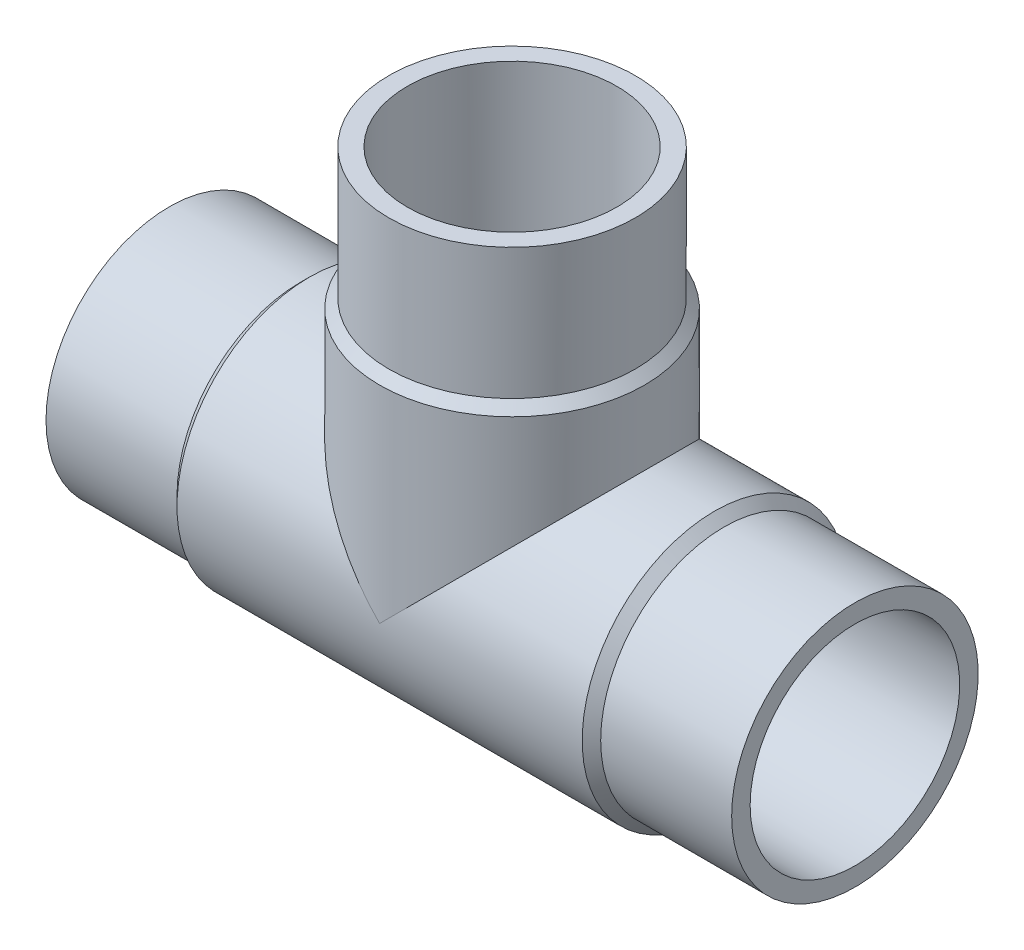
ISO-10303-21;
HEADER;
FILE_DESCRIPTION(('STEP AP214'),'2;1');
FILE_NAME('part.step','',(''),(''),'','','');
FILE_SCHEMA(('AUTOMOTIVE_DESIGN { 1 0 10303 214 1 1 1 1 }'));
ENDSEC;
DATA;
#1=APPLICATION_CONTEXT('core data for automotive mechanical design processes');
#2=APPLICATION_PROTOCOL_DEFINITION('international standard','automotive_design',2000,#1);
#3=PRODUCT_CONTEXT('',#1,'mechanical');
#4=PRODUCT('Part','Part','',(#3));
#5=PRODUCT_RELATED_PRODUCT_CATEGORY('part','',(#4));
#6=PRODUCT_DEFINITION_FORMATION('','',#4);
#7=PRODUCT_DEFINITION_CONTEXT('part definition',#1,'design');
#8=PRODUCT_DEFINITION('design','',#6,#7);
#9=PRODUCT_DEFINITION_SHAPE('','',#8);
#10=(LENGTH_UNIT() NAMED_UNIT(*) SI_UNIT(.MILLI.,.METRE.));
#11=(NAMED_UNIT(*) PLANE_ANGLE_UNIT() SI_UNIT($,.RADIAN.));
#12=(NAMED_UNIT(*) SI_UNIT($,.STERADIAN.) SOLID_ANGLE_UNIT());
#13=UNCERTAINTY_MEASURE_WITH_UNIT(LENGTH_MEASURE(1.E-05),#10,'distance_accuracy_value','');
#14=(GEOMETRIC_REPRESENTATION_CONTEXT(3) GLOBAL_UNCERTAINTY_ASSIGNED_CONTEXT((#13)) GLOBAL_UNIT_ASSIGNED_CONTEXT((#10,
#11,#12)) REPRESENTATION_CONTEXT('',''));
#15=CARTESIAN_POINT('',(0.,0.,0.));
#16=DIRECTION('',(0.,0.,1.));
#17=DIRECTION('',(1.,0.,0.));
#18=AXIS2_PLACEMENT_3D('',#15,#16,#17);
#19=CARTESIAN_POINT('',(-44.5,45.,0.));
#20=DIRECTION('',(0.,1.,0.));
#21=DIRECTION('',(0.,0.,1.));
#22=AXIS2_PLACEMENT_3D('',#19,#20,#21);
#23=CYLINDRICAL_SURFACE('',#22,16.);
#24=CARTESIAN_POINT('',(-44.5,45.,0.));
#25=DIRECTION('',(0.,1.,0.));
#26=DIRECTION('',(0.,0.,1.));
#27=AXIS2_PLACEMENT_3D('',#24,#25,#26);
#28=CIRCLE('',#27,16.);
#29=CARTESIAN_POINT('',(-44.5,45.,16.));
#30=VERTEX_POINT('',#29);
#31=EDGE_CURVE('E18',#30,#30,#28,.T.);
#32=ORIENTED_EDGE('',*,*,#31,.F.);
#33=EDGE_LOOP('',(#32));
#34=FACE_BOUND('',#33,.T.);
#35=CARTESIAN_POINT('',(-44.5,28.,0.));
#36=DIRECTION('',(0.,1.,0.));
#37=DIRECTION('',(1.,0.,0.));
#38=AXIS2_PLACEMENT_3D('',#35,#36,#37);
#39=CIRCLE('',#38,16.);
#40=CARTESIAN_POINT('',(-28.5,28.,0.));
#41=VERTEX_POINT('',#40);
#42=EDGE_CURVE('E71',#41,#41,#39,.F.);
#43=ORIENTED_EDGE('',*,*,#42,.F.);
#44=EDGE_LOOP('',(#43));
#45=FACE_BOUND('',#44,.T.);
#46=ADVANCED_FACE('F15',(#34,#45),#23,.T.);
#47=CARTESIAN_POINT('',(-44.5,28.,0.));
#48=DIRECTION('',(0.,-1.,0.));
#49=DIRECTION('',(0.,0.,-1.));
#50=AXIS2_PLACEMENT_3D('',#47,#48,#49);
#51=CONICAL_SURFACE('',#50,16.,0.785398163397469);
#52=CARTESIAN_POINT('',(-44.5,26.8,0.));
#53=DIRECTION('',(0.,1.,0.));
#54=DIRECTION('',(1.,0.,0.));
#55=AXIS2_PLACEMENT_3D('',#52,#53,#54);
#56=CIRCLE('',#55,17.2);
#57=CARTESIAN_POINT('',(-27.3,26.8,0.));
#58=VERTEX_POINT('',#57);
#59=EDGE_CURVE('E60',#58,#58,#56,.F.);
#60=ORIENTED_EDGE('',*,*,#59,.F.);
#61=EDGE_LOOP('',(#60));
#62=FACE_BOUND('',#61,.T.);
#63=ORIENTED_EDGE('',*,*,#42,.T.);
#64=EDGE_LOOP('',(#63));
#65=FACE_BOUND('',#64,.T.);
#66=ADVANCED_FACE('F141',(#62,#65),#51,.T.);
#67=CARTESIAN_POINT('',(-17.,0.,0.));
#68=DIRECTION('',(-1.,0.,0.));
#69=DIRECTION('',(0.,0.,1.));
#70=AXIS2_PLACEMENT_3D('',#67,#68,#69);
#71=CYLINDRICAL_SURFACE('',#70,16.);
#72=CARTESIAN_POINT('',(-17.,0.,0.));
#73=DIRECTION('',(1.,0.,0.));
#74=DIRECTION('',(0.,1.,0.));
#75=AXIS2_PLACEMENT_3D('',#72,#73,#74);
#76=CIRCLE('',#75,16.);
#77=CARTESIAN_POINT('',(-17.,16.,0.));
#78=VERTEX_POINT('',#77);
#79=EDGE_CURVE('E64',#78,#78,#76,.F.);
#80=ORIENTED_EDGE('',*,*,#79,.F.);
#81=EDGE_LOOP('',(#80));
#82=FACE_BOUND('',#81,.T.);
#83=CARTESIAN_POINT('',(0.,0.,0.));
#84=DIRECTION('',(-1.,0.,0.));
#85=DIRECTION('',(0.,0.,1.));
#86=AXIS2_PLACEMENT_3D('',#83,#84,#85);
#87=CIRCLE('',#86,16.);
#88=CARTESIAN_POINT('',(0.,0.,16.));
#89=VERTEX_POINT('',#88);
#90=EDGE_CURVE('E58',#89,#89,#87,.F.);
#91=ORIENTED_EDGE('',*,*,#90,.F.);
#92=EDGE_LOOP('',(#91));
#93=FACE_BOUND('',#92,.T.);
#94=ADVANCED_FACE('F136',(#82,#93),#71,.T.);
#95=CARTESIAN_POINT('',(-60.5,45.,16.1920021083504));
#96=DIRECTION('',(0.,1.,0.));
#97=DIRECTION('',(1.,0.,0.));
#98=AXIS2_PLACEMENT_3D('',#95,#96,#97);
#99=PLANE('',#98);
#100=CARTESIAN_POINT('',(-44.5,45.,0.));
#101=DIRECTION('',(0.,1.,0.));
#102=DIRECTION('',(0.,0.,1.));
#103=AXIS2_PLACEMENT_3D('',#100,#101,#102);
#104=CIRCLE('',#103,13.6);
#105=CARTESIAN_POINT('',(-44.5,45.,13.6));
#106=VERTEX_POINT('',#105);
#107=EDGE_CURVE('E52',#106,#106,#104,.T.);
#108=ORIENTED_EDGE('',*,*,#107,.F.);
#109=EDGE_LOOP('',(#108));
#110=FACE_BOUND('',#109,.T.);
#111=ORIENTED_EDGE('',*,*,#31,.T.);
#112=EDGE_LOOP('',(#111));
#113=FACE_BOUND('',#112,.T.);
#114=ADVANCED_FACE('F130',(#110,#113),#99,.T.);
#115=CARTESIAN_POINT('',(-17.,0.,0.));
#116=DIRECTION('',(-1.,0.,0.));
#117=DIRECTION('',(0.,0.,1.));
#118=AXIS2_PLACEMENT_3D('',#115,#116,#117);
#119=CONICAL_SURFACE('',#118,16.,0.78539816339744);
#120=ORIENTED_EDGE('',*,*,#79,.T.);
#121=EDGE_LOOP('',(#120));
#122=FACE_BOUND('',#121,.T.);
#123=CARTESIAN_POINT('',(-18.2,0.,0.));
#124=DIRECTION('',(-1.,0.,0.));
#125=DIRECTION('',(0.,1.,0.));
#126=AXIS2_PLACEMENT_3D('',#123,#124,#125);
#127=CIRCLE('',#126,17.2);
#128=CARTESIAN_POINT('',(-18.2,17.2,0.));
#129=VERTEX_POINT('',#128);
#130=EDGE_CURVE('E49',#129,#129,#127,.T.);
#131=ORIENTED_EDGE('',*,*,#130,.F.);
#132=EDGE_LOOP('',(#131));
#133=FACE_BOUND('',#132,.T.);
#134=ADVANCED_FACE('F95',(#122,#133),#119,.T.);
#135=CARTESIAN_POINT('',(-44.5,26.8,0.));
#136=DIRECTION('',(0.,1.,0.));
#137=DIRECTION('',(0.,0.,1.));
#138=AXIS2_PLACEMENT_3D('',#135,#136,#137);
#139=CYLINDRICAL_SURFACE('',#138,17.2);
#140=CARTESIAN_POINT('',(-44.5,0.,0.));
#141=DIRECTION('',(0.707106781186547,0.707106781186547,0.));
#142=DIRECTION('',(-0.707106781186547,0.707106781186547,0.));
#143=AXIS2_PLACEMENT_3D('',#140,#141,#142);
#144=ELLIPSE('',#143,24.3244732728172,17.2);
#145=CARTESIAN_POINT('',(-44.5,0.,17.2));
#146=VERTEX_POINT('',#145);
#147=CARTESIAN_POINT('',(-44.5,0.,-17.2));
#148=VERTEX_POINT('',#147);
#149=EDGE_CURVE('E44',#146,#148,#144,.F.);
#150=ORIENTED_EDGE('',*,*,#149,.F.);
#151=CARTESIAN_POINT('',(-44.5,0.,0.));
#152=DIRECTION('',(-0.707106781186547,0.707106781186547,0.));
#153=DIRECTION('',(-0.707106781186547,-0.707106781186547,0.));
#154=AXIS2_PLACEMENT_3D('',#151,#152,#153);
#155=ELLIPSE('',#154,24.3244732728172,17.2);
#156=EDGE_CURVE('E40',#148,#146,#155,.F.);
#157=ORIENTED_EDGE('',*,*,#156,.F.);
#158=EDGE_LOOP('',(#150,#157));
#159=FACE_BOUND('',#158,.T.);
#160=ORIENTED_EDGE('',*,*,#59,.T.);
#161=EDGE_LOOP('',(#160));
#162=FACE_BOUND('',#161,.T.);
#163=ADVANCED_FACE('F47',(#159,#162),#139,.T.);
#164=CARTESIAN_POINT('',(0.,16.,16.1920021082986));
#165=DIRECTION('',(1.,0.,0.));
#166=DIRECTION('',(0.,-1.,0.));
#167=AXIS2_PLACEMENT_3D('',#164,#165,#166);
#168=PLANE('',#167);
#169=CARTESIAN_POINT('',(0.,0.,0.));
#170=DIRECTION('',(-1.,0.,0.));
#171=DIRECTION('',(0.,0.,1.));
#172=AXIS2_PLACEMENT_3D('',#169,#170,#171);
#173=CIRCLE('',#172,13.6);
#174=CARTESIAN_POINT('',(0.,0.,13.6));
#175=VERTEX_POINT('',#174);
#176=EDGE_CURVE('E45',#175,#175,#173,.F.);
#177=ORIENTED_EDGE('',*,*,#176,.F.);
#178=EDGE_LOOP('',(#177));
#179=FACE_BOUND('',#178,.T.);
#180=ORIENTED_EDGE('',*,*,#90,.T.);
#181=EDGE_LOOP('',(#180));
#182=FACE_BOUND('',#181,.T.);
#183=ADVANCED_FACE('F85',(#179,#182),#168,.T.);
#184=CARTESIAN_POINT('',(-44.5,0.,0.));
#185=DIRECTION('',(0.,1.,0.));
#186=DIRECTION('',(0.,0.,1.));
#187=AXIS2_PLACEMENT_3D('',#184,#185,#186);
#188=CYLINDRICAL_SURFACE('',#187,13.6);
#189=CARTESIAN_POINT('',(-44.5,0.,0.));
#190=DIRECTION('',(-0.707106781186547,-0.707106781186547,0.));
#191=DIRECTION('',(-0.707106781186547,0.707106781186547,0.));
#192=AXIS2_PLACEMENT_3D('',#189,#190,#191);
#193=ELLIPSE('',#192,19.2333044482741,13.6);
#194=CARTESIAN_POINT('',(-44.5,0.,-13.6));
#195=VERTEX_POINT('',#194);
#196=CARTESIAN_POINT('',(-44.5,0.,13.6));
#197=VERTEX_POINT('',#196);
#198=EDGE_CURVE('E78',#195,#197,#193,.F.);
#199=ORIENTED_EDGE('',*,*,#198,.F.);
#200=CARTESIAN_POINT('',(-44.5,0.,0.));
#201=DIRECTION('',(-0.707106781186547,0.707106781186547,0.));
#202=DIRECTION('',(0.707106781186547,0.707106781186547,0.));
#203=AXIS2_PLACEMENT_3D('',#200,#201,#202);
#204=ELLIPSE('',#203,19.2333044482741,13.6);
#205=EDGE_CURVE('E32',#195,#197,#204,.F.);
#206=ORIENTED_EDGE('',*,*,#205,.T.);
#207=EDGE_LOOP('',(#199,#206));
#208=FACE_BOUND('',#207,.T.);
#209=ORIENTED_EDGE('',*,*,#107,.T.);
#210=EDGE_LOOP('',(#209));
#211=FACE_BOUND('',#210,.T.);
#212=ADVANCED_FACE('F87',(#208,#211),#188,.F.);
#213=CARTESIAN_POINT('',(-70.8,0.,0.));
#214=DIRECTION('',(-1.,0.,0.));
#215=DIRECTION('',(0.,0.,1.));
#216=AXIS2_PLACEMENT_3D('',#213,#214,#215);
#217=CYLINDRICAL_SURFACE('',#216,17.2);
#218=ORIENTED_EDGE('',*,*,#130,.T.);
#219=EDGE_LOOP('',(#218));
#220=FACE_BOUND('',#219,.T.);
#221=CARTESIAN_POINT('',(-70.8,0.,0.));
#222=DIRECTION('',(-1.,0.,0.));
#223=DIRECTION('',(0.,1.,0.));
#224=AXIS2_PLACEMENT_3D('',#221,#222,#223);
#225=CIRCLE('',#224,17.2);
#226=CARTESIAN_POINT('',(-70.8,17.2,0.));
#227=VERTEX_POINT('',#226);
#228=EDGE_CURVE('E77',#227,#227,#225,.T.);
#229=ORIENTED_EDGE('',*,*,#228,.F.);
#230=EDGE_LOOP('',(#229));
#231=FACE_BOUND('',#230,.T.);
#232=ORIENTED_EDGE('',*,*,#149,.T.);
#233=ORIENTED_EDGE('',*,*,#156,.T.);
#234=EDGE_LOOP('',(#232,#233));
#235=FACE_BOUND('',#234,.T.);
#236=ADVANCED_FACE('F43',(#220,#231,#235),#217,.T.);
#237=CARTESIAN_POINT('',(-44.5,0.,0.));
#238=DIRECTION('',(-1.,0.,0.));
#239=DIRECTION('',(0.,0.,1.));
#240=AXIS2_PLACEMENT_3D('',#237,#238,#239);
#241=CYLINDRICAL_SURFACE('',#240,13.6);
#242=ORIENTED_EDGE('',*,*,#205,.F.);
#243=ORIENTED_EDGE('',*,*,#198,.T.);
#244=EDGE_LOOP('',(#242,#243));
#245=FACE_BOUND('',#244,.T.);
#246=ORIENTED_EDGE('',*,*,#176,.T.);
#247=EDGE_LOOP('',(#246));
#248=FACE_BOUND('',#247,.T.);
#249=CARTESIAN_POINT('',(-89.,0.,0.));
#250=DIRECTION('',(-1.,0.,0.));
#251=DIRECTION('',(0.,0.,1.));
#252=AXIS2_PLACEMENT_3D('',#249,#250,#251);
#253=CIRCLE('',#252,13.6);
#254=CARTESIAN_POINT('',(-89.,0.,13.6));
#255=VERTEX_POINT('',#254);
#256=EDGE_CURVE('E74',#255,#255,#253,.F.);
#257=ORIENTED_EDGE('',*,*,#256,.F.);
#258=EDGE_LOOP('',(#257));
#259=FACE_BOUND('',#258,.T.);
#260=ADVANCED_FACE('F82',(#245,#248,#259),#241,.F.);
#261=CARTESIAN_POINT('',(-72.,0.,0.));
#262=DIRECTION('',(1.,0.,0.));
#263=DIRECTION('',(0.,0.,-1.));
#264=AXIS2_PLACEMENT_3D('',#261,#262,#263);
#265=CONICAL_SURFACE('',#264,16.,0.785398163397445);
#266=ORIENTED_EDGE('',*,*,#228,.T.);
#267=EDGE_LOOP('',(#266));
#268=FACE_BOUND('',#267,.T.);
#269=CARTESIAN_POINT('',(-72.,0.,0.));
#270=DIRECTION('',(-1.,0.,0.));
#271=DIRECTION('',(0.,1.,0.));
#272=AXIS2_PLACEMENT_3D('',#269,#270,#271);
#273=CIRCLE('',#272,16.);
#274=CARTESIAN_POINT('',(-72.,16.,0.));
#275=VERTEX_POINT('',#274);
#276=EDGE_CURVE('E24',#275,#275,#273,.T.);
#277=ORIENTED_EDGE('',*,*,#276,.F.);
#278=EDGE_LOOP('',(#277));
#279=FACE_BOUND('',#278,.T.);
#280=ADVANCED_FACE('F105',(#268,#279),#265,.T.);
#281=CARTESIAN_POINT('',(-89.,-16.,16.1920021084034));
#282=DIRECTION('',(-1.,0.,0.));
#283=DIRECTION('',(0.,1.,0.));
#284=AXIS2_PLACEMENT_3D('',#281,#282,#283);
#285=PLANE('',#284);
#286=ORIENTED_EDGE('',*,*,#256,.T.);
#287=EDGE_LOOP('',(#286));
#288=FACE_BOUND('',#287,.T.);
#289=CARTESIAN_POINT('',(-89.,0.,0.));
#290=DIRECTION('',(-1.,0.,0.));
#291=DIRECTION('',(0.,0.,1.));
#292=AXIS2_PLACEMENT_3D('',#289,#290,#291);
#293=CIRCLE('',#292,16.);
#294=CARTESIAN_POINT('',(-89.,0.,16.));
#295=VERTEX_POINT('',#294);
#296=EDGE_CURVE('E9',#295,#295,#293,.F.);
#297=ORIENTED_EDGE('',*,*,#296,.F.);
#298=EDGE_LOOP('',(#297));
#299=FACE_BOUND('',#298,.T.);
#300=ADVANCED_FACE('F99',(#288,#299),#285,.T.);
#301=CARTESIAN_POINT('',(-89.,0.,0.));
#302=DIRECTION('',(-1.,0.,0.));
#303=DIRECTION('',(0.,0.,1.));
#304=AXIS2_PLACEMENT_3D('',#301,#302,#303);
#305=CYLINDRICAL_SURFACE('',#304,16.);
#306=ORIENTED_EDGE('',*,*,#276,.T.);
#307=EDGE_LOOP('',(#306));
#308=FACE_BOUND('',#307,.T.);
#309=ORIENTED_EDGE('',*,*,#296,.T.);
#310=EDGE_LOOP('',(#309));
#311=FACE_BOUND('',#310,.T.);
#312=ADVANCED_FACE('F97',(#308,#311),#305,.T.);
#313=CLOSED_SHELL('',(#46,#66,#94,#114,#134,#163,#183,#212,#236,#260,#280,#300,#312));
#314=MANIFOLD_SOLID_BREP('B1',#313);
#315=ADVANCED_BREP_SHAPE_REPRESENTATION('',(#18,#314),#14);
#316=SHAPE_DEFINITION_REPRESENTATION(#9,#315);
ENDSEC;
END-ISO-10303-21;
